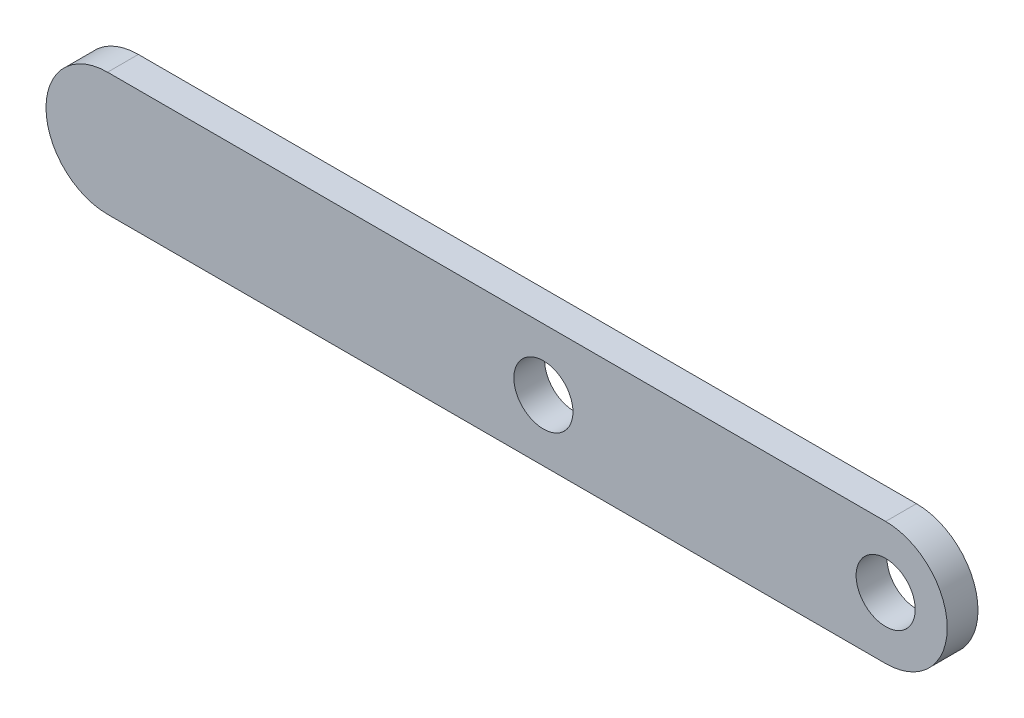
ISO-10303-21;
HEADER;
FILE_DESCRIPTION(('STEP AP214'),'2;1');
FILE_NAME('part.step','',(''),(''),'','','');
FILE_SCHEMA(('AUTOMOTIVE_DESIGN { 1 0 10303 214 1 1 1 1 }'));
ENDSEC;
DATA;
#1=APPLICATION_CONTEXT('core data for automotive mechanical design processes');
#2=APPLICATION_PROTOCOL_DEFINITION('international standard','automotive_design',2000,#1);
#3=PRODUCT_CONTEXT('',#1,'mechanical');
#4=PRODUCT('Part','Part','',(#3));
#5=PRODUCT_RELATED_PRODUCT_CATEGORY('part','',(#4));
#6=PRODUCT_DEFINITION_FORMATION('','',#4);
#7=PRODUCT_DEFINITION_CONTEXT('part definition',#1,'design');
#8=PRODUCT_DEFINITION('design','',#6,#7);
#9=PRODUCT_DEFINITION_SHAPE('','',#8);
#10=(LENGTH_UNIT() NAMED_UNIT(*) SI_UNIT(.MILLI.,.METRE.));
#11=(NAMED_UNIT(*) PLANE_ANGLE_UNIT() SI_UNIT($,.RADIAN.));
#12=(NAMED_UNIT(*) SI_UNIT($,.STERADIAN.) SOLID_ANGLE_UNIT());
#13=UNCERTAINTY_MEASURE_WITH_UNIT(LENGTH_MEASURE(1.E-05),#10,'distance_accuracy_value','');
#14=(GEOMETRIC_REPRESENTATION_CONTEXT(3) GLOBAL_UNCERTAINTY_ASSIGNED_CONTEXT((#13)) GLOBAL_UNIT_ASSIGNED_CONTEXT((#10,
#11,#12)) REPRESENTATION_CONTEXT('',''));
#15=CARTESIAN_POINT('',(0.,0.,0.));
#16=DIRECTION('',(0.,0.,1.));
#17=DIRECTION('',(1.,0.,0.));
#18=AXIS2_PLACEMENT_3D('',#15,#16,#17);
#19=CARTESIAN_POINT('',(40.132,0.,3.175));
#20=DIRECTION('',(0.,0.,1.));
#21=DIRECTION('',(1.,0.,0.));
#22=AXIS2_PLACEMENT_3D('',#19,#20,#21);
#23=PLANE('',#22);
#24=CARTESIAN_POINT('',(40.132,0.,3.175));
#25=DIRECTION('',(0.,0.,1.));
#26=DIRECTION('',(1.,0.,0.));
#27=AXIS2_PLACEMENT_3D('',#24,#25,#26);
#28=CIRCLE('',#27,3.048);
#29=CARTESIAN_POINT('',(43.18,0.,3.175));
#30=VERTEX_POINT('',#29);
#31=EDGE_CURVE('E112',#30,#30,#28,.T.);
#32=ORIENTED_EDGE('',*,*,#31,.F.);
#33=EDGE_LOOP('',(#32));
#34=FACE_BOUND('',#33,.T.);
#35=CARTESIAN_POINT('',(40.132,0.,3.175));
#36=DIRECTION('',(0.,0.,1.));
#37=DIRECTION('',(1.,0.,0.));
#38=AXIS2_PLACEMENT_3D('',#35,#36,#37);
#39=CIRCLE('',#38,6.35);
#40=CARTESIAN_POINT('',(40.132,-6.35,3.175));
#41=VERTEX_POINT('',#40);
#42=CARTESIAN_POINT('',(40.132,6.35,3.175));
#43=VERTEX_POINT('',#42);
#44=EDGE_CURVE('E92',#41,#43,#39,.T.);
#45=ORIENTED_EDGE('',*,*,#44,.T.);
#46=DIRECTION('',(-1.,0.,0.));
#47=VECTOR('',#46,1.);
#48=CARTESIAN_POINT('',(-40.132,6.35,3.175));
#49=LINE('',#48,#47);
#50=CARTESIAN_POINT('',(-40.132,6.35,3.175));
#51=VERTEX_POINT('',#50);
#52=EDGE_CURVE('E87',#43,#51,#49,.T.);
#53=ORIENTED_EDGE('',*,*,#52,.T.);
#54=CARTESIAN_POINT('',(-40.132,0.,3.175));
#55=DIRECTION('',(0.,0.,1.));
#56=DIRECTION('',(1.,0.,0.));
#57=AXIS2_PLACEMENT_3D('',#54,#55,#56);
#58=CIRCLE('',#57,6.35);
#59=CARTESIAN_POINT('',(-40.132,-6.35,3.175));
#60=VERTEX_POINT('',#59);
#61=EDGE_CURVE('E90',#51,#60,#58,.T.);
#62=ORIENTED_EDGE('',*,*,#61,.T.);
#63=DIRECTION('',(1.,0.,0.));
#64=VECTOR('',#63,1.);
#65=CARTESIAN_POINT('',(-40.132,-6.35,3.175));
#66=LINE('',#65,#64);
#67=EDGE_CURVE('E57',#60,#41,#66,.T.);
#68=ORIENTED_EDGE('',*,*,#67,.T.);
#69=EDGE_LOOP('',(#45,#53,#62,#68));
#70=FACE_BOUND('',#69,.T.);
#71=CARTESIAN_POINT('',(4.82600000000001,0.,3.175));
#72=DIRECTION('',(0.,0.,1.));
#73=DIRECTION('',(1.,0.,0.));
#74=AXIS2_PLACEMENT_3D('',#71,#72,#73);
#75=CIRCLE('',#74,3.048);
#76=CARTESIAN_POINT('',(7.87400000000001,0.,3.175));
#77=VERTEX_POINT('',#76);
#78=EDGE_CURVE('E134',#77,#77,#75,.T.);
#79=ORIENTED_EDGE('',*,*,#78,.F.);
#80=EDGE_LOOP('',(#79));
#81=FACE_BOUND('',#80,.T.);
#82=ADVANCED_FACE('F39',(#34,#70,#81),#23,.T.);
#83=CARTESIAN_POINT('',(40.132,0.,0.));
#84=DIRECTION('',(0.,0.,1.));
#85=DIRECTION('',(1.,0.,0.));
#86=AXIS2_PLACEMENT_3D('',#83,#84,#85);
#87=PLANE('',#86);
#88=CARTESIAN_POINT('',(40.132,0.,0.));
#89=DIRECTION('',(0.,0.,1.));
#90=DIRECTION('',(1.,0.,0.));
#91=AXIS2_PLACEMENT_3D('',#88,#89,#90);
#92=CIRCLE('',#91,6.35);
#93=CARTESIAN_POINT('',(40.132,-6.35,0.));
#94=VERTEX_POINT('',#93);
#95=CARTESIAN_POINT('',(40.132,6.35,0.));
#96=VERTEX_POINT('',#95);
#97=EDGE_CURVE('E108',#94,#96,#92,.T.);
#98=ORIENTED_EDGE('',*,*,#97,.F.);
#99=DIRECTION('',(1.,0.,0.));
#100=VECTOR('',#99,1.);
#101=CARTESIAN_POINT('',(-40.132,-6.35,0.));
#102=LINE('',#101,#100);
#103=CARTESIAN_POINT('',(-40.132,-6.35,0.));
#104=VERTEX_POINT('',#103);
#105=EDGE_CURVE('E80',#104,#94,#102,.T.);
#106=ORIENTED_EDGE('',*,*,#105,.F.);
#107=CARTESIAN_POINT('',(-40.132,0.,0.));
#108=DIRECTION('',(0.,0.,1.));
#109=DIRECTION('',(1.,0.,0.));
#110=AXIS2_PLACEMENT_3D('',#107,#108,#109);
#111=CIRCLE('',#110,6.35);
#112=CARTESIAN_POINT('',(-40.132,6.35,0.));
#113=VERTEX_POINT('',#112);
#114=EDGE_CURVE('E74',#113,#104,#111,.T.);
#115=ORIENTED_EDGE('',*,*,#114,.F.);
#116=DIRECTION('',(-1.,0.,0.));
#117=VECTOR('',#116,1.);
#118=CARTESIAN_POINT('',(-40.132,6.35,0.));
#119=LINE('',#118,#117);
#120=EDGE_CURVE('E97',#96,#113,#119,.T.);
#121=ORIENTED_EDGE('',*,*,#120,.F.);
#122=EDGE_LOOP('',(#98,#106,#115,#121));
#123=FACE_BOUND('',#122,.T.);
#124=CARTESIAN_POINT('',(40.132,0.,0.));
#125=DIRECTION('',(0.,0.,1.));
#126=DIRECTION('',(1.,0.,0.));
#127=AXIS2_PLACEMENT_3D('',#124,#125,#126);
#128=CIRCLE('',#127,3.048);
#129=CARTESIAN_POINT('',(43.18,0.,0.));
#130=VERTEX_POINT('',#129);
#131=EDGE_CURVE('E130',#130,#130,#128,.T.);
#132=ORIENTED_EDGE('',*,*,#131,.T.);
#133=EDGE_LOOP('',(#132));
#134=FACE_BOUND('',#133,.T.);
#135=CARTESIAN_POINT('',(4.82600000000001,0.,0.));
#136=DIRECTION('',(0.,0.,1.));
#137=DIRECTION('',(1.,0.,0.));
#138=AXIS2_PLACEMENT_3D('',#135,#136,#137);
#139=CIRCLE('',#138,3.048);
#140=CARTESIAN_POINT('',(7.87400000000001,0.,0.));
#141=VERTEX_POINT('',#140);
#142=EDGE_CURVE('E138',#141,#141,#139,.T.);
#143=ORIENTED_EDGE('',*,*,#142,.T.);
#144=EDGE_LOOP('',(#143));
#145=FACE_BOUND('',#144,.T.);
#146=ADVANCED_FACE('F125',(#123,#134,#145),#87,.F.);
#147=CARTESIAN_POINT('',(40.132,0.,3.175));
#148=DIRECTION('',(0.,0.,-1.));
#149=DIRECTION('',(-1.,0.,0.));
#150=AXIS2_PLACEMENT_3D('',#147,#148,#149);
#151=CYLINDRICAL_SURFACE('',#150,6.35);
#152=ORIENTED_EDGE('',*,*,#97,.T.);
#153=DIRECTION('',(0.,0.,-1.));
#154=VECTOR('',#153,1.);
#155=CARTESIAN_POINT('',(40.132,6.35,3.175));
#156=LINE('',#155,#154);
#157=EDGE_CURVE('E11',#43,#96,#156,.T.);
#158=ORIENTED_EDGE('',*,*,#157,.F.);
#159=ORIENTED_EDGE('',*,*,#44,.F.);
#160=DIRECTION('',(0.,0.,-1.));
#161=VECTOR('',#160,1.);
#162=CARTESIAN_POINT('',(40.132,-6.35,3.175));
#163=LINE('',#162,#161);
#164=EDGE_CURVE('E104',#41,#94,#163,.T.);
#165=ORIENTED_EDGE('',*,*,#164,.T.);
#166=EDGE_LOOP('',(#152,#158,#159,#165));
#167=FACE_BOUND('',#166,.T.);
#168=ADVANCED_FACE('F41',(#167),#151,.T.);
#169=CARTESIAN_POINT('',(-40.132,6.35,3.175));
#170=DIRECTION('',(0.,-1.,0.));
#171=DIRECTION('',(0.,0.,-1.));
#172=AXIS2_PLACEMENT_3D('',#169,#170,#171);
#173=PLANE('',#172);
#174=ORIENTED_EDGE('',*,*,#120,.T.);
#175=DIRECTION('',(0.,0.,-1.));
#176=VECTOR('',#175,1.);
#177=CARTESIAN_POINT('',(-40.132,6.35,3.175));
#178=LINE('',#177,#176);
#179=EDGE_CURVE('E49',#51,#113,#178,.T.);
#180=ORIENTED_EDGE('',*,*,#179,.F.);
#181=ORIENTED_EDGE('',*,*,#52,.F.);
#182=ORIENTED_EDGE('',*,*,#157,.T.);
#183=EDGE_LOOP('',(#174,#180,#181,#182));
#184=FACE_BOUND('',#183,.T.);
#185=ADVANCED_FACE('F96',(#184),#173,.F.);
#186=CARTESIAN_POINT('',(-40.132,0.,3.175));
#187=DIRECTION('',(0.,0.,-1.));
#188=DIRECTION('',(-1.,0.,0.));
#189=AXIS2_PLACEMENT_3D('',#186,#187,#188);
#190=CYLINDRICAL_SURFACE('',#189,6.35);
#191=ORIENTED_EDGE('',*,*,#114,.T.);
#192=DIRECTION('',(0.,0.,-1.));
#193=VECTOR('',#192,1.);
#194=CARTESIAN_POINT('',(-40.132,-6.35,3.175));
#195=LINE('',#194,#193);
#196=EDGE_CURVE('E99',#60,#104,#195,.T.);
#197=ORIENTED_EDGE('',*,*,#196,.F.);
#198=ORIENTED_EDGE('',*,*,#61,.F.);
#199=ORIENTED_EDGE('',*,*,#179,.T.);
#200=EDGE_LOOP('',(#191,#197,#198,#199));
#201=FACE_BOUND('',#200,.T.);
#202=ADVANCED_FACE('F100',(#201),#190,.T.);
#203=CARTESIAN_POINT('',(-40.132,-6.35,3.175));
#204=DIRECTION('',(0.,1.,0.));
#205=DIRECTION('',(0.,0.,1.));
#206=AXIS2_PLACEMENT_3D('',#203,#204,#205);
#207=PLANE('',#206);
#208=ORIENTED_EDGE('',*,*,#105,.T.);
#209=ORIENTED_EDGE('',*,*,#164,.F.);
#210=ORIENTED_EDGE('',*,*,#67,.F.);
#211=ORIENTED_EDGE('',*,*,#196,.T.);
#212=EDGE_LOOP('',(#208,#209,#210,#211));
#213=FACE_BOUND('',#212,.T.);
#214=ADVANCED_FACE('F122',(#213),#207,.F.);
#215=CARTESIAN_POINT('',(40.132,0.,3.175));
#216=DIRECTION('',(0.,0.,-1.));
#217=DIRECTION('',(-1.,0.,0.));
#218=AXIS2_PLACEMENT_3D('',#215,#216,#217);
#219=CYLINDRICAL_SURFACE('',#218,3.048);
#220=ORIENTED_EDGE('',*,*,#31,.T.);
#221=EDGE_LOOP('',(#220));
#222=FACE_BOUND('',#221,.T.);
#223=ORIENTED_EDGE('',*,*,#131,.F.);
#224=EDGE_LOOP('',(#223));
#225=FACE_BOUND('',#224,.T.);
#226=ADVANCED_FACE('F157',(#222,#225),#219,.F.);
#227=CARTESIAN_POINT('',(4.82600000000001,0.,3.175));
#228=DIRECTION('',(0.,0.,-1.));
#229=DIRECTION('',(-1.,0.,0.));
#230=AXIS2_PLACEMENT_3D('',#227,#228,#229);
#231=CYLINDRICAL_SURFACE('',#230,3.048);
#232=ORIENTED_EDGE('',*,*,#78,.T.);
#233=EDGE_LOOP('',(#232));
#234=FACE_BOUND('',#233,.T.);
#235=ORIENTED_EDGE('',*,*,#142,.F.);
#236=EDGE_LOOP('',(#235));
#237=FACE_BOUND('',#236,.T.);
#238=ADVANCED_FACE('F146',(#234,#237),#231,.F.);
#239=CLOSED_SHELL('',(#82,#146,#168,#185,#202,#214,#226,#238));
#240=MANIFOLD_SOLID_BREP('B2',#239);
#241=ADVANCED_BREP_SHAPE_REPRESENTATION('',(#18,#240),#14);
#242=SHAPE_DEFINITION_REPRESENTATION(#9,#241);
ENDSEC;
END-ISO-10303-21;
